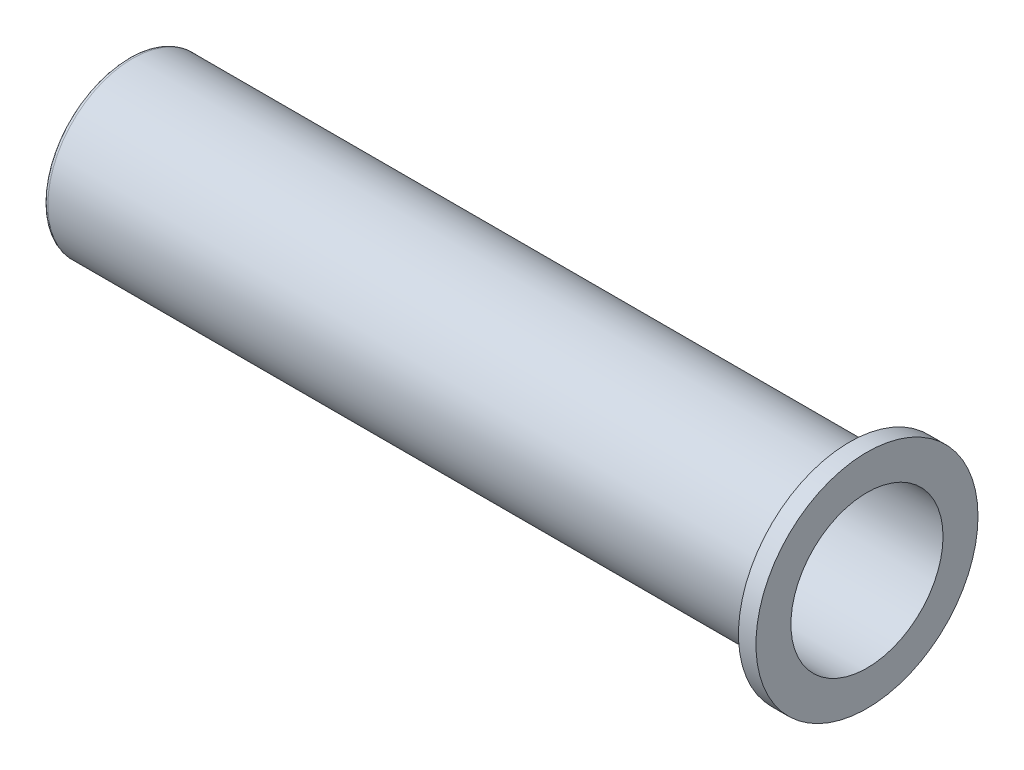
ISO-10303-21;
HEADER;
FILE_DESCRIPTION(('STEP AP214'),'2;1');
FILE_NAME('part.step','',(''),(''),'','','');
FILE_SCHEMA(('AUTOMOTIVE_DESIGN { 1 0 10303 214 1 1 1 1 }'));
ENDSEC;
DATA;
#1=APPLICATION_CONTEXT('core data for automotive mechanical design processes');
#2=APPLICATION_PROTOCOL_DEFINITION('international standard','automotive_design',2000,#1);
#3=PRODUCT_CONTEXT('',#1,'mechanical');
#4=PRODUCT('Part','Part','',(#3));
#5=PRODUCT_RELATED_PRODUCT_CATEGORY('part','',(#4));
#6=PRODUCT_DEFINITION_FORMATION('','',#4);
#7=PRODUCT_DEFINITION_CONTEXT('part definition',#1,'design');
#8=PRODUCT_DEFINITION('design','',#6,#7);
#9=PRODUCT_DEFINITION_SHAPE('','',#8);
#10=(LENGTH_UNIT() NAMED_UNIT(*) SI_UNIT(.MILLI.,.METRE.));
#11=(NAMED_UNIT(*) PLANE_ANGLE_UNIT() SI_UNIT($,.RADIAN.));
#12=(NAMED_UNIT(*) SI_UNIT($,.STERADIAN.) SOLID_ANGLE_UNIT());
#13=UNCERTAINTY_MEASURE_WITH_UNIT(LENGTH_MEASURE(1.E-05),#10,'distance_accuracy_value','');
#14=(GEOMETRIC_REPRESENTATION_CONTEXT(3) GLOBAL_UNCERTAINTY_ASSIGNED_CONTEXT((#13)) GLOBAL_UNIT_ASSIGNED_CONTEXT((#10,
#11,#12)) REPRESENTATION_CONTEXT('',''));
#15=CARTESIAN_POINT('',(0.,0.,0.));
#16=DIRECTION('',(0.,0.,1.));
#17=DIRECTION('',(1.,0.,0.));
#18=AXIS2_PLACEMENT_3D('',#15,#16,#17);
#19=CARTESIAN_POINT('',(5.75,0.,-4.85));
#20=DIRECTION('',(-1.,0.,0.));
#21=DIRECTION('',(0.,0.,1.));
#22=AXIS2_PLACEMENT_3D('',#19,#20,#21);
#23=PLANE('',#22);
#24=CARTESIAN_POINT('',(5.75,0.,0.));
#25=DIRECTION('',(1.,0.,0.));
#26=DIRECTION('',(0.,0.,-1.));
#27=AXIS2_PLACEMENT_3D('',#24,#25,#26);
#28=CIRCLE('',#27,4.85);
#29=CARTESIAN_POINT('',(5.75,0.,-4.85));
#30=VERTEX_POINT('',#29);
#31=EDGE_CURVE('E64',#30,#30,#28,.T.);
#32=ORIENTED_EDGE('',*,*,#31,.T.);
#33=EDGE_LOOP('',(#32));
#34=FACE_BOUND('',#33,.T.);
#35=CARTESIAN_POINT('',(5.75,0.,0.));
#36=DIRECTION('',(1.,0.,0.));
#37=DIRECTION('',(0.,0.,-1.));
#38=AXIS2_PLACEMENT_3D('',#35,#36,#37);
#39=CIRCLE('',#38,6.35);
#40=CARTESIAN_POINT('',(5.75,0.,-6.35));
#41=VERTEX_POINT('',#40);
#42=EDGE_CURVE('E55',#41,#41,#39,.T.);
#43=ORIENTED_EDGE('',*,*,#42,.F.);
#44=EDGE_LOOP('',(#43));
#45=FACE_BOUND('',#44,.T.);
#46=ADVANCED_FACE('F35',(#34,#45),#23,.T.);
#47=CARTESIAN_POINT('',(0.,0.,0.));
#48=DIRECTION('',(1.,0.,0.));
#49=DIRECTION('',(0.,0.,-1.));
#50=AXIS2_PLACEMENT_3D('',#47,#48,#49);
#51=CYLINDRICAL_SURFACE('',#50,6.35);
#52=ORIENTED_EDGE('',*,*,#42,.T.);
#53=EDGE_LOOP('',(#52));
#54=FACE_BOUND('',#53,.T.);
#55=CARTESIAN_POINT('',(6.75,0.,0.));
#56=DIRECTION('',(1.,0.,0.));
#57=DIRECTION('',(0.,0.,-1.));
#58=AXIS2_PLACEMENT_3D('',#55,#56,#57);
#59=CIRCLE('',#58,6.35);
#60=CARTESIAN_POINT('',(6.75,0.,-6.35));
#61=VERTEX_POINT('',#60);
#62=EDGE_CURVE('E58',#61,#61,#59,.T.);
#63=ORIENTED_EDGE('',*,*,#62,.F.);
#64=EDGE_LOOP('',(#63));
#65=FACE_BOUND('',#64,.T.);
#66=ADVANCED_FACE('F91',(#54,#65),#51,.T.);
#67=CARTESIAN_POINT('',(6.75,0.,-6.35));
#68=DIRECTION('',(1.,0.,0.));
#69=DIRECTION('',(0.,0.,-1.));
#70=AXIS2_PLACEMENT_3D('',#67,#68,#69);
#71=PLANE('',#70);
#72=ORIENTED_EDGE('',*,*,#62,.T.);
#73=EDGE_LOOP('',(#72));
#74=FACE_BOUND('',#73,.T.);
#75=CARTESIAN_POINT('',(6.75,0.,0.));
#76=DIRECTION('',(1.,0.,0.));
#77=DIRECTION('',(0.,0.,-1.));
#78=AXIS2_PLACEMENT_3D('',#75,#76,#77);
#79=CIRCLE('',#78,4.35);
#80=CARTESIAN_POINT('',(6.75,0.,-4.35));
#81=VERTEX_POINT('',#80);
#82=EDGE_CURVE('E61',#81,#81,#79,.T.);
#83=ORIENTED_EDGE('',*,*,#82,.F.);
#84=EDGE_LOOP('',(#83));
#85=FACE_BOUND('',#84,.T.);
#86=ADVANCED_FACE('F97',(#74,#85),#71,.T.);
#87=CARTESIAN_POINT('',(0.,0.,0.));
#88=DIRECTION('',(1.,0.,0.));
#89=DIRECTION('',(0.,0.,-1.));
#90=AXIS2_PLACEMENT_3D('',#87,#88,#89);
#91=CYLINDRICAL_SURFACE('',#90,4.35);
#92=CARTESIAN_POINT('',(-34.75,0.,0.));
#93=DIRECTION('',(-1.,0.,0.));
#94=DIRECTION('',(0.,0.,1.));
#95=AXIS2_PLACEMENT_3D('',#92,#93,#94);
#96=CIRCLE('',#95,4.35);
#97=CARTESIAN_POINT('',(-34.75,0.,4.35));
#98=VERTEX_POINT('',#97);
#99=EDGE_CURVE('E46',#98,#98,#96,.T.);
#100=ORIENTED_EDGE('',*,*,#99,.T.);
#101=EDGE_LOOP('',(#100));
#102=FACE_BOUND('',#101,.T.);
#103=ORIENTED_EDGE('',*,*,#82,.T.);
#104=EDGE_LOOP('',(#103));
#105=FACE_BOUND('',#104,.T.);
#106=ADVANCED_FACE('F114',(#102,#105),#91,.F.);
#107=CARTESIAN_POINT('',(0.,0.,0.));
#108=DIRECTION('',(1.,0.,0.));
#109=DIRECTION('',(0.,0.,-1.));
#110=AXIS2_PLACEMENT_3D('',#107,#108,#109);
#111=CYLINDRICAL_SURFACE('',#110,4.85);
#112=CARTESIAN_POINT('',(-35.25,0.,0.));
#113=DIRECTION('',(-1.,0.,0.));
#114=DIRECTION('',(0.,0.,1.));
#115=AXIS2_PLACEMENT_3D('',#112,#113,#114);
#116=CIRCLE('',#115,4.85);
#117=CARTESIAN_POINT('',(-35.25,0.,4.85));
#118=VERTEX_POINT('',#117);
#119=EDGE_CURVE('E10',#118,#118,#116,.F.);
#120=ORIENTED_EDGE('',*,*,#119,.T.);
#121=EDGE_LOOP('',(#120));
#122=FACE_BOUND('',#121,.T.);
#123=ORIENTED_EDGE('',*,*,#31,.F.);
#124=EDGE_LOOP('',(#123));
#125=FACE_BOUND('',#124,.T.);
#126=ADVANCED_FACE('F87',(#122,#125),#111,.T.);
#127=CARTESIAN_POINT('',(-35.,0.,0.));
#128=DIRECTION('',(-1.,0.,0.));
#129=DIRECTION('',(0.,0.,1.));
#130=AXIS2_PLACEMENT_3D('',#127,#128,#129);
#131=PLANE('',#130);
#132=CARTESIAN_POINT('',(-35.,0.,0.));
#133=DIRECTION('',(-1.,0.,0.));
#134=DIRECTION('',(0.,0.,1.));
#135=AXIS2_PLACEMENT_3D('',#132,#133,#134);
#136=CIRCLE('',#135,4.1);
#137=CARTESIAN_POINT('',(-35.,0.,4.1));
#138=VERTEX_POINT('',#137);
#139=EDGE_CURVE('E50',#138,#138,#136,.F.);
#140=ORIENTED_EDGE('',*,*,#139,.T.);
#141=EDGE_LOOP('',(#140));
#142=FACE_BOUND('',#141,.T.);
#143=CARTESIAN_POINT('',(-35.,0.,0.));
#144=DIRECTION('',(-1.,0.,0.));
#145=DIRECTION('',(0.,0.,1.));
#146=AXIS2_PLACEMENT_3D('',#143,#144,#145);
#147=CIRCLE('',#146,2.75);
#148=CARTESIAN_POINT('',(-35.,0.,2.75));
#149=VERTEX_POINT('',#148);
#150=EDGE_CURVE('E68',#149,#149,#147,.T.);
#151=ORIENTED_EDGE('',*,*,#150,.T.);
#152=EDGE_LOOP('',(#151));
#153=FACE_BOUND('',#152,.T.);
#154=ADVANCED_FACE('F79',(#142,#153),#131,.F.);
#155=CARTESIAN_POINT('',(-35.5,0.,0.));
#156=DIRECTION('',(-1.,0.,0.));
#157=DIRECTION('',(0.,0.,1.));
#158=AXIS2_PLACEMENT_3D('',#155,#156,#157);
#159=PLANE('',#158);
#160=CARTESIAN_POINT('',(-35.5,0.,0.));
#161=DIRECTION('',(-1.,0.,0.));
#162=DIRECTION('',(0.,0.,1.));
#163=AXIS2_PLACEMENT_3D('',#160,#161,#162);
#164=CIRCLE('',#163,4.59999999999999);
#165=CARTESIAN_POINT('',(-35.5,0.,4.59999999999999));
#166=VERTEX_POINT('',#165);
#167=EDGE_CURVE('E42',#166,#166,#164,.T.);
#168=ORIENTED_EDGE('',*,*,#167,.T.);
#169=EDGE_LOOP('',(#168));
#170=FACE_BOUND('',#169,.T.);
#171=CARTESIAN_POINT('',(-35.5,0.,0.));
#172=DIRECTION('',(-1.,0.,0.));
#173=DIRECTION('',(0.,0.,1.));
#174=AXIS2_PLACEMENT_3D('',#171,#172,#173);
#175=CIRCLE('',#174,2.75);
#176=CARTESIAN_POINT('',(-35.5,0.,2.75));
#177=VERTEX_POINT('',#176);
#178=EDGE_CURVE('E67',#177,#177,#175,.T.);
#179=ORIENTED_EDGE('',*,*,#178,.F.);
#180=EDGE_LOOP('',(#179));
#181=FACE_BOUND('',#180,.T.);
#182=ADVANCED_FACE('F77',(#170,#181),#159,.T.);
#183=CARTESIAN_POINT('',(-35.5,0.,0.));
#184=DIRECTION('',(1.,0.,0.));
#185=DIRECTION('',(0.,0.,-1.));
#186=AXIS2_PLACEMENT_3D('',#183,#184,#185);
#187=CYLINDRICAL_SURFACE('',#186,2.75);
#188=ORIENTED_EDGE('',*,*,#178,.T.);
#189=EDGE_LOOP('',(#188));
#190=FACE_BOUND('',#189,.T.);
#191=ORIENTED_EDGE('',*,*,#150,.F.);
#192=EDGE_LOOP('',(#191));
#193=FACE_BOUND('',#192,.T.);
#194=ADVANCED_FACE('F74',(#190,#193),#187,.F.);
#195=CARTESIAN_POINT('',(-34.75,0.,0.));
#196=DIRECTION('',(-1.,0.,0.));
#197=DIRECTION('',(0.,0.,1.));
#198=AXIS2_PLACEMENT_3D('',#195,#196,#197);
#199=TOROIDAL_SURFACE('',#198,4.1,0.25);
#200=ORIENTED_EDGE('',*,*,#99,.F.);
#201=EDGE_LOOP('',(#200));
#202=FACE_BOUND('',#201,.T.);
#203=ORIENTED_EDGE('',*,*,#139,.F.);
#204=EDGE_LOOP('',(#203));
#205=FACE_BOUND('',#204,.T.);
#206=ADVANCED_FACE('F85',(#202,#205),#199,.F.);
#207=CARTESIAN_POINT('',(-35.25,0.,0.));
#208=DIRECTION('',(-1.,0.,0.));
#209=DIRECTION('',(0.,0.,1.));
#210=AXIS2_PLACEMENT_3D('',#207,#208,#209);
#211=TOROIDAL_SURFACE('',#210,4.59999999999999,0.25);
#212=ORIENTED_EDGE('',*,*,#119,.F.);
#213=EDGE_LOOP('',(#212));
#214=FACE_BOUND('',#213,.T.);
#215=ORIENTED_EDGE('',*,*,#167,.F.);
#216=EDGE_LOOP('',(#215));
#217=FACE_BOUND('',#216,.T.);
#218=ADVANCED_FACE('F37',(#214,#217),#211,.T.);
#219=CLOSED_SHELL('',(#46,#66,#86,#106,#126,#154,#182,#194,#206,#218));
#220=MANIFOLD_SOLID_BREP('B2',#219);
#221=ADVANCED_BREP_SHAPE_REPRESENTATION('',(#18,#220),#14);
#222=SHAPE_DEFINITION_REPRESENTATION(#9,#221);
ENDSEC;
END-ISO-10303-21;
